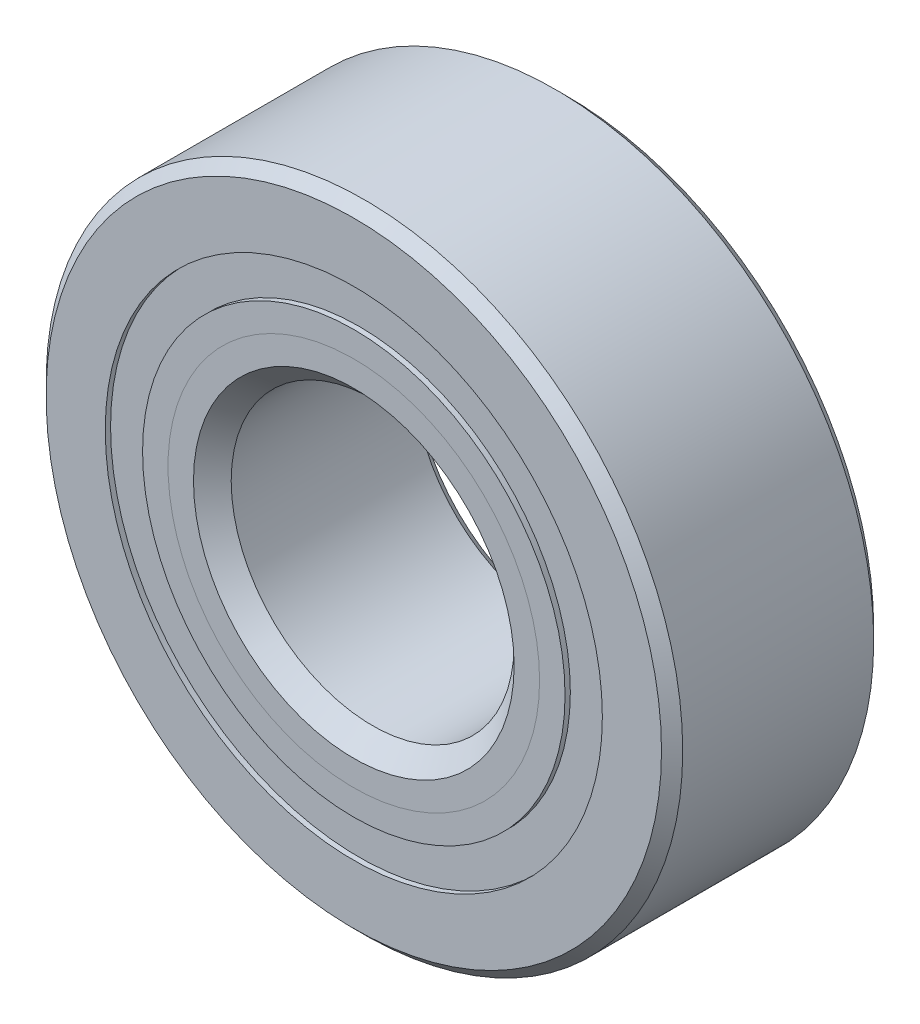
ISO-10303-21;
HEADER;
FILE_DESCRIPTION(('STEP AP214'),'2;1');
FILE_NAME('part.step','',(''),(''),'','','');
FILE_SCHEMA(('AUTOMOTIVE_DESIGN { 1 0 10303 214 1 1 1 1 }'));
ENDSEC;
DATA;
#1=APPLICATION_CONTEXT('core data for automotive mechanical design processes');
#2=APPLICATION_PROTOCOL_DEFINITION('international standard','automotive_design',2000,#1);
#3=PRODUCT_CONTEXT('',#1,'mechanical');
#4=PRODUCT('Part','Part','',(#3));
#5=PRODUCT_RELATED_PRODUCT_CATEGORY('part','',(#4));
#6=PRODUCT_DEFINITION_FORMATION('','',#4);
#7=PRODUCT_DEFINITION_CONTEXT('part definition',#1,'design');
#8=PRODUCT_DEFINITION('design','',#6,#7);
#9=PRODUCT_DEFINITION_SHAPE('','',#8);
#10=(LENGTH_UNIT() NAMED_UNIT(*) SI_UNIT(.MILLI.,.METRE.));
#11=(NAMED_UNIT(*) PLANE_ANGLE_UNIT() SI_UNIT($,.RADIAN.));
#12=(NAMED_UNIT(*) SI_UNIT($,.STERADIAN.) SOLID_ANGLE_UNIT());
#13=UNCERTAINTY_MEASURE_WITH_UNIT(LENGTH_MEASURE(1.E-05),#10,'distance_accuracy_value','');
#14=(GEOMETRIC_REPRESENTATION_CONTEXT(3) GLOBAL_UNCERTAINTY_ASSIGNED_CONTEXT((#13)) GLOBAL_UNIT_ASSIGNED_CONTEXT((#10,
#11,#12)) REPRESENTATION_CONTEXT('',''));
#15=CARTESIAN_POINT('',(0.,0.,0.));
#16=DIRECTION('',(0.,0.,1.));
#17=DIRECTION('',(1.,0.,0.));
#18=AXIS2_PLACEMENT_3D('',#15,#16,#17);
#19=CARTESIAN_POINT('',(0.,11.1561126373626,-4.524375));
#20=DIRECTION('',(0.,0.,1.));
#21=DIRECTION('',(1.,0.,0.));
#22=AXIS2_PLACEMENT_3D('',#19,#20,#21);
#23=PLANE('',#22);
#24=CARTESIAN_POINT('',(0.,0.,-4.524375));
#25=DIRECTION('',(0.,0.,1.));
#26=DIRECTION('',(1.,0.,0.));
#27=AXIS2_PLACEMENT_3D('',#24,#25,#26);
#28=CIRCLE('',#27,11.1561126373626);
#29=CARTESIAN_POINT('',(11.1561126373626,0.,-4.524375));
#30=VERTEX_POINT('',#29);
#31=EDGE_CURVE('E57',#30,#30,#28,.T.);
#32=ORIENTED_EDGE('',*,*,#31,.F.);
#33=EDGE_LOOP('',(#32));
#34=FACE_BOUND('',#33,.T.);
#35=CARTESIAN_POINT('',(0.,0.,-4.524375));
#36=DIRECTION('',(0.,0.,1.));
#37=DIRECTION('',(1.,0.,0.));
#38=AXIS2_PLACEMENT_3D('',#35,#36,#37);
#39=CIRCLE('',#38,9.48138736263737);
#40=CARTESIAN_POINT('',(9.48138736263737,0.,-4.524375));
#41=VERTEX_POINT('',#40);
#42=EDGE_CURVE('E11',#41,#41,#39,.T.);
#43=ORIENTED_EDGE('',*,*,#42,.T.);
#44=EDGE_LOOP('',(#43));
#45=FACE_BOUND('',#44,.T.);
#46=ADVANCED_FACE('F43',(#34,#45),#23,.F.);
#47=CARTESIAN_POINT('',(0.,0.,4.7625));
#48=DIRECTION('',(0.,0.,1.));
#49=DIRECTION('',(1.,0.,0.));
#50=AXIS2_PLACEMENT_3D('',#47,#48,#49);
#51=CYLINDRICAL_SURFACE('',#50,9.48138736263737);
#52=ORIENTED_EDGE('',*,*,#42,.F.);
#53=EDGE_LOOP('',(#52));
#54=FACE_BOUND('',#53,.T.);
#55=CARTESIAN_POINT('',(0.,0.,-2.27628073054021));
#56=DIRECTION('',(0.,0.,1.));
#57=DIRECTION('',(1.,0.,0.));
#58=AXIS2_PLACEMENT_3D('',#55,#56,#57);
#59=CIRCLE('',#58,9.48138736263736);
#60=CARTESIAN_POINT('',(9.48138736263736,0.,-2.27628073054021));
#61=VERTEX_POINT('',#60);
#62=EDGE_CURVE('E49',#61,#61,#59,.T.);
#63=ORIENTED_EDGE('',*,*,#62,.T.);
#64=EDGE_LOOP('',(#63));
#65=FACE_BOUND('',#64,.T.);
#66=ADVANCED_FACE('F66',(#54,#65),#51,.F.);
#67=CARTESIAN_POINT('',(0.,11.1561126373626,-2.27628073054021));
#68=DIRECTION('',(0.,0.,-1.));
#69=DIRECTION('',(-1.,0.,0.));
#70=AXIS2_PLACEMENT_3D('',#67,#68,#69);
#71=PLANE('',#70);
#72=ORIENTED_EDGE('',*,*,#62,.F.);
#73=EDGE_LOOP('',(#72));
#74=FACE_BOUND('',#73,.T.);
#75=CARTESIAN_POINT('',(0.,0.,-2.27628073054021));
#76=DIRECTION('',(0.,0.,1.));
#77=DIRECTION('',(1.,0.,0.));
#78=AXIS2_PLACEMENT_3D('',#75,#76,#77);
#79=CIRCLE('',#78,11.1561126373626);
#80=CARTESIAN_POINT('',(11.1561126373626,0.,-2.27628073054021));
#81=VERTEX_POINT('',#80);
#82=EDGE_CURVE('E53',#81,#81,#79,.T.);
#83=ORIENTED_EDGE('',*,*,#82,.T.);
#84=EDGE_LOOP('',(#83));
#85=FACE_BOUND('',#84,.T.);
#86=ADVANCED_FACE('F70',(#74,#85),#71,.F.);
#87=CARTESIAN_POINT('',(0.,0.,4.7625));
#88=DIRECTION('',(0.,0.,1.));
#89=DIRECTION('',(1.,0.,0.));
#90=AXIS2_PLACEMENT_3D('',#87,#88,#89);
#91=CYLINDRICAL_SURFACE('',#90,11.1561126373626);
#92=ORIENTED_EDGE('',*,*,#82,.F.);
#93=EDGE_LOOP('',(#92));
#94=FACE_BOUND('',#93,.T.);
#95=ORIENTED_EDGE('',*,*,#31,.T.);
#96=EDGE_LOOP('',(#95));
#97=FACE_BOUND('',#96,.T.);
#98=ADVANCED_FACE('F63',(#94,#97),#91,.T.);
#99=CLOSED_SHELL('',(#46,#66,#86,#98));
#100=MANIFOLD_SOLID_BREP('B2',#99);
#101=CARTESIAN_POINT('',(0.,11.1561126373626,4.524375));
#102=DIRECTION('',(0.,0.,-1.));
#103=DIRECTION('',(-1.,0.,0.));
#104=AXIS2_PLACEMENT_3D('',#101,#102,#103);
#105=PLANE('',#104);
#106=CARTESIAN_POINT('',(0.,0.,4.524375));
#107=DIRECTION('',(0.,0.,1.));
#108=DIRECTION('',(1.,0.,0.));
#109=AXIS2_PLACEMENT_3D('',#106,#107,#108);
#110=CIRCLE('',#109,9.48138736263736);
#111=CARTESIAN_POINT('',(9.48138736263736,0.,4.524375));
#112=VERTEX_POINT('',#111);
#113=EDGE_CURVE('E42',#112,#112,#110,.T.);
#114=ORIENTED_EDGE('',*,*,#113,.F.);
#115=EDGE_LOOP('',(#114));
#116=FACE_BOUND('',#115,.T.);
#117=CARTESIAN_POINT('',(0.,0.,4.524375));
#118=DIRECTION('',(0.,0.,1.));
#119=DIRECTION('',(1.,0.,0.));
#120=AXIS2_PLACEMENT_3D('',#117,#118,#119);
#121=CIRCLE('',#120,11.1561126373626);
#122=CARTESIAN_POINT('',(11.1561126373626,0.,4.524375));
#123=VERTEX_POINT('',#122);
#124=EDGE_CURVE('E124',#123,#123,#121,.T.);
#125=ORIENTED_EDGE('',*,*,#124,.T.);
#126=EDGE_LOOP('',(#125));
#127=FACE_BOUND('',#126,.T.);
#128=ADVANCED_FACE('F110',(#116,#127),#105,.F.);
#129=CARTESIAN_POINT('',(0.,0.,4.7625));
#130=DIRECTION('',(0.,0.,1.));
#131=DIRECTION('',(1.,0.,0.));
#132=AXIS2_PLACEMENT_3D('',#129,#130,#131);
#133=CYLINDRICAL_SURFACE('',#132,9.48138736263736);
#134=CARTESIAN_POINT('',(0.,0.,2.27628073054021));
#135=DIRECTION('',(0.,0.,1.));
#136=DIRECTION('',(1.,0.,0.));
#137=AXIS2_PLACEMENT_3D('',#134,#135,#136);
#138=CIRCLE('',#137,9.48138736263736);
#139=CARTESIAN_POINT('',(9.48138736263736,0.,2.27628073054021));
#140=VERTEX_POINT('',#139);
#141=EDGE_CURVE('E116',#140,#140,#138,.T.);
#142=ORIENTED_EDGE('',*,*,#141,.F.);
#143=EDGE_LOOP('',(#142));
#144=FACE_BOUND('',#143,.T.);
#145=ORIENTED_EDGE('',*,*,#113,.T.);
#146=EDGE_LOOP('',(#145));
#147=FACE_BOUND('',#146,.T.);
#148=ADVANCED_FACE('F139',(#144,#147),#133,.F.);
#149=CARTESIAN_POINT('',(0.,11.1561126373626,2.27628073054021));
#150=DIRECTION('',(0.,0.,1.));
#151=DIRECTION('',(1.,0.,0.));
#152=AXIS2_PLACEMENT_3D('',#149,#150,#151);
#153=PLANE('',#152);
#154=CARTESIAN_POINT('',(0.,0.,2.27628073054021));
#155=DIRECTION('',(0.,0.,1.));
#156=DIRECTION('',(1.,0.,0.));
#157=AXIS2_PLACEMENT_3D('',#154,#155,#156);
#158=CIRCLE('',#157,11.1561126373626);
#159=CARTESIAN_POINT('',(11.1561126373626,0.,2.27628073054021));
#160=VERTEX_POINT('',#159);
#161=EDGE_CURVE('E120',#160,#160,#158,.T.);
#162=ORIENTED_EDGE('',*,*,#161,.F.);
#163=EDGE_LOOP('',(#162));
#164=FACE_BOUND('',#163,.T.);
#165=ORIENTED_EDGE('',*,*,#141,.T.);
#166=EDGE_LOOP('',(#165));
#167=FACE_BOUND('',#166,.T.);
#168=ADVANCED_FACE('F134',(#164,#167),#153,.F.);
#169=CARTESIAN_POINT('',(0.,0.,4.7625));
#170=DIRECTION('',(0.,0.,1.));
#171=DIRECTION('',(1.,0.,0.));
#172=AXIS2_PLACEMENT_3D('',#169,#170,#171);
#173=CYLINDRICAL_SURFACE('',#172,11.1561126373626);
#174=ORIENTED_EDGE('',*,*,#124,.F.);
#175=EDGE_LOOP('',(#174));
#176=FACE_BOUND('',#175,.T.);
#177=ORIENTED_EDGE('',*,*,#161,.T.);
#178=EDGE_LOOP('',(#177));
#179=FACE_BOUND('',#178,.T.);
#180=ADVANCED_FACE('F131',(#176,#179),#173,.T.);
#181=CLOSED_SHELL('',(#128,#148,#168,#180));
#182=MANIFOLD_SOLID_BREP('B6',#181);
#183=CARTESIAN_POINT('',(-6.06520907209285,8.34804411070657,0.));
#184=DIRECTION('',(0.,0.,1.));
#185=DIRECTION('',(-0.587785252292462,0.809016994374955,0.));
#186=AXIS2_PLACEMENT_3D('',#183,#184,#185);
#187=SPHERICAL_SURFACE('',#186,2.27628073054021);
#188=CARTESIAN_POINT('',(-6.06520907209285,8.34804411070657,2.27628073054021));
#189=VERTEX_POINT('',#188);
#190=VERTEX_LOOP('',#189);
#191=FACE_BOUND('',#190,.T.);
#192=ADVANCED_FACE('F177',(#191),#187,.T.);
#193=CLOSED_SHELL('',(#192));
#194=MANIFOLD_SOLID_BREP('B37',#193);
#195=CARTESIAN_POINT('',(-9.81371442752058,3.1886691107066,0.));
#196=DIRECTION('',(0.,0.,1.));
#197=DIRECTION('',(-0.95105651629515,0.309016994374958,0.));
#198=AXIS2_PLACEMENT_3D('',#195,#196,#197);
#199=SPHERICAL_SURFACE('',#198,2.27628073054021);
#200=CARTESIAN_POINT('',(-9.81371442752058,3.1886691107066,2.27628073054021));
#201=VERTEX_POINT('',#200);
#202=VERTEX_LOOP('',#201);
#203=FACE_BOUND('',#202,.T.);
#204=ADVANCED_FACE('F210',(#203),#199,.T.);
#205=CLOSED_SHELL('',(#204));
#206=MANIFOLD_SOLID_BREP('B106',#205);
#207=CARTESIAN_POINT('',(-9.81371442752065,-3.18866911070639,0.));
#208=DIRECTION('',(0.,0.,1.));
#209=DIRECTION('',(-0.951056516295157,-0.309016994374938,0.));
#210=AXIS2_PLACEMENT_3D('',#207,#208,#209);
#211=SPHERICAL_SURFACE('',#210,2.27628073054021);
#212=CARTESIAN_POINT('',(-9.81371442752065,-3.18866911070639,2.27628073054021));
#213=VERTEX_POINT('',#212);
#214=VERTEX_LOOP('',#213);
#215=FACE_BOUND('',#214,.T.);
#216=ADVANCED_FACE('F241',(#215),#211,.T.);
#217=CLOSED_SHELL('',(#216));
#218=MANIFOLD_SOLID_BREP('B173',#217);
#219=CARTESIAN_POINT('',(-6.06520907209303,-8.34804411070643,0.));
#220=DIRECTION('',(0.,0.,1.));
#221=DIRECTION('',(-0.58778525229248,-0.809016994374942,0.));
#222=AXIS2_PLACEMENT_3D('',#219,#220,#221);
#223=SPHERICAL_SURFACE('',#222,2.27628073054021);
#224=CARTESIAN_POINT('',(-6.06520907209303,-8.34804411070643,2.27628073054021));
#225=VERTEX_POINT('',#224);
#226=VERTEX_LOOP('',#225);
#227=FACE_BOUND('',#226,.T.);
#228=ADVANCED_FACE('F272',(#227),#223,.T.);
#229=CLOSED_SHELL('',(#228));
#230=MANIFOLD_SOLID_BREP('B206',#229);
#231=CARTESIAN_POINT('',(0.,-10.31875,0.));
#232=DIRECTION('',(0.,0.,1.));
#233=DIRECTION('',(0.,-1.,0.));
#234=AXIS2_PLACEMENT_3D('',#231,#232,#233);
#235=SPHERICAL_SURFACE('',#234,2.27628073054021);
#236=CARTESIAN_POINT('',(0.,-10.31875,2.27628073054021));
#237=VERTEX_POINT('',#236);
#238=VERTEX_LOOP('',#237);
#239=FACE_BOUND('',#238,.T.);
#240=ADVANCED_FACE('F305',(#239),#235,.T.);
#241=CLOSED_SHELL('',(#240));
#242=MANIFOLD_SOLID_BREP('B237',#241);
#243=CARTESIAN_POINT('',(6.06520907209291,-8.34804411070652,0.));
#244=DIRECTION('',(0.,0.,1.));
#245=DIRECTION('',(0.587785252292469,-0.809016994374951,0.));
#246=AXIS2_PLACEMENT_3D('',#243,#244,#245);
#247=SPHERICAL_SURFACE('',#246,2.27628073054021);
#248=CARTESIAN_POINT('',(6.06520907209291,-8.34804411070652,2.27628073054021));
#249=VERTEX_POINT('',#248);
#250=VERTEX_LOOP('',#249);
#251=FACE_BOUND('',#250,.T.);
#252=ADVANCED_FACE('F338',(#251),#247,.T.);
#253=CLOSED_SHELL('',(#252));
#254=MANIFOLD_SOLID_BREP('B268',#253);
#255=CARTESIAN_POINT('',(9.8137144275206,-3.18866911070653,0.));
#256=DIRECTION('',(0.,0.,1.));
#257=DIRECTION('',(0.951056516295152,-0.309016994374952,0.));
#258=AXIS2_PLACEMENT_3D('',#255,#256,#257);
#259=SPHERICAL_SURFACE('',#258,2.27628073054021);
#260=CARTESIAN_POINT('',(9.8137144275206,-3.18866911070653,2.27628073054021));
#261=VERTEX_POINT('',#260);
#262=VERTEX_LOOP('',#261);
#263=FACE_BOUND('',#262,.T.);
#264=ADVANCED_FACE('F371',(#263),#259,.T.);
#265=CLOSED_SHELL('',(#264));
#266=MANIFOLD_SOLID_BREP('B301',#265);
#267=CARTESIAN_POINT('',(9.81371442752063,3.18866911070646,0.));
#268=DIRECTION('',(0.,0.,1.));
#269=DIRECTION('',(0.951056516295155,0.309016994374945,0.));
#270=AXIS2_PLACEMENT_3D('',#267,#268,#269);
#271=SPHERICAL_SURFACE('',#270,2.27628073054021);
#272=CARTESIAN_POINT('',(9.81371442752063,3.18866911070646,2.27628073054021));
#273=VERTEX_POINT('',#272);
#274=VERTEX_LOOP('',#273);
#275=FACE_BOUND('',#274,.T.);
#276=ADVANCED_FACE('F402',(#275),#271,.T.);
#277=CLOSED_SHELL('',(#276));
#278=MANIFOLD_SOLID_BREP('B334',#277);
#279=CARTESIAN_POINT('',(6.06520907209297,8.34804411070648,0.));
#280=DIRECTION('',(0.,0.,1.));
#281=DIRECTION('',(0.587785252292474,0.809016994374947,0.));
#282=AXIS2_PLACEMENT_3D('',#279,#280,#281);
#283=SPHERICAL_SURFACE('',#282,2.27628073054021);
#284=CARTESIAN_POINT('',(6.06520907209297,8.34804411070648,2.27628073054021));
#285=VERTEX_POINT('',#284);
#286=VERTEX_LOOP('',#285);
#287=FACE_BOUND('',#286,.T.);
#288=ADVANCED_FACE('F435',(#287),#283,.T.);
#289=CLOSED_SHELL('',(#288));
#290=MANIFOLD_SOLID_BREP('B367',#289);
#291=CARTESIAN_POINT('',(0.,10.31875,0.));
#292=DIRECTION('',(0.,0.,1.));
#293=DIRECTION('',(0.,1.,0.));
#294=AXIS2_PLACEMENT_3D('',#291,#292,#293);
#295=SPHERICAL_SURFACE('',#294,2.27628073054021);
#296=CARTESIAN_POINT('',(0.,10.31875,2.27628073054021));
#297=VERTEX_POINT('',#296);
#298=VERTEX_LOOP('',#297);
#299=FACE_BOUND('',#298,.T.);
#300=ADVANCED_FACE('F470',(#299),#295,.T.);
#301=CLOSED_SHELL('',(#300));
#302=MANIFOLD_SOLID_BREP('B398',#301);
#303=CARTESIAN_POINT('',(0.,8.33881099868363,4.7625));
#304=DIRECTION('',(0.,0.,-1.));
#305=DIRECTION('',(-1.,0.,0.));
#306=AXIS2_PLACEMENT_3D('',#303,#304,#305);
#307=PLANE('',#306);
#308=CARTESIAN_POINT('',(0.,0.,4.7625));
#309=DIRECTION('',(0.,0.,1.));
#310=DIRECTION('',(1.,0.,0.));
#311=AXIS2_PLACEMENT_3D('',#308,#309,#310);
#312=CIRCLE('',#311,7.19623463472989);
#313=CARTESIAN_POINT('',(7.19623463472989,0.,4.7625));
#314=VERTEX_POINT('',#313);
#315=EDGE_CURVE('E524',#314,#314,#312,.T.);
#316=ORIENTED_EDGE('',*,*,#315,.F.);
#317=EDGE_LOOP('',(#316));
#318=FACE_BOUND('',#317,.T.);
#319=CARTESIAN_POINT('',(0.,0.,4.7625));
#320=DIRECTION('',(0.,0.,1.));
#321=DIRECTION('',(1.,0.,0.));
#322=AXIS2_PLACEMENT_3D('',#319,#320,#321);
#323=CIRCLE('',#322,8.33881099868363);
#324=CARTESIAN_POINT('',(8.33881099868363,0.,4.7625));
#325=VERTEX_POINT('',#324);
#326=EDGE_CURVE('E469',#325,#325,#323,.T.);
#327=ORIENTED_EDGE('',*,*,#326,.T.);
#328=EDGE_LOOP('',(#327));
#329=FACE_BOUND('',#328,.T.);
#330=ADVANCED_FACE('F490',(#318,#329),#307,.F.);
#331=CARTESIAN_POINT('',(0.,0.,3.61992363604627));
#332=DIRECTION('',(0.,0.,1.));
#333=DIRECTION('',(1.,0.,0.));
#334=AXIS2_PLACEMENT_3D('',#331,#332,#333);
#335=CONICAL_SURFACE('',#334,7.19623463472989,0.78539816339745);
#336=ORIENTED_EDGE('',*,*,#326,.F.);
#337=EDGE_LOOP('',(#336));
#338=FACE_BOUND('',#337,.T.);
#339=CARTESIAN_POINT('',(0.,0.,3.61992363604627));
#340=DIRECTION('',(0.,0.,1.));
#341=DIRECTION('',(1.,0.,0.));
#342=AXIS2_PLACEMENT_3D('',#339,#340,#341);
#343=CIRCLE('',#342,7.19623463472989);
#344=CARTESIAN_POINT('',(7.19623463472989,0.,3.61992363604627));
#345=VERTEX_POINT('',#344);
#346=EDGE_CURVE('E496',#345,#345,#343,.T.);
#347=ORIENTED_EDGE('',*,*,#346,.T.);
#348=EDGE_LOOP('',(#347));
#349=FACE_BOUND('',#348,.T.);
#350=ADVANCED_FACE('F531',(#338,#349),#335,.T.);
#351=CARTESIAN_POINT('',(0.,0.,4.7625));
#352=DIRECTION('',(0.,0.,1.));
#353=DIRECTION('',(1.,0.,0.));
#354=AXIS2_PLACEMENT_3D('',#351,#352,#353);
#355=CYLINDRICAL_SURFACE('',#354,7.19623463472989);
#356=ORIENTED_EDGE('',*,*,#346,.F.);
#357=EDGE_LOOP('',(#356));
#358=FACE_BOUND('',#357,.T.);
#359=CARTESIAN_POINT('',(0.,0.,0.));
#360=DIRECTION('',(0.,0.,1.));
#361=DIRECTION('',(1.,0.,0.));
#362=AXIS2_PLACEMENT_3D('',#359,#360,#361);
#363=CIRCLE('',#362,7.19623463472989);
#364=CARTESIAN_POINT('',(7.19623463472989,0.,0.));
#365=VERTEX_POINT('',#364);
#366=EDGE_CURVE('E500',#365,#365,#363,.T.);
#367=ORIENTED_EDGE('',*,*,#366,.T.);
#368=EDGE_LOOP('',(#367));
#369=FACE_BOUND('',#368,.T.);
#370=ADVANCED_FACE('F535',(#358,#369),#355,.T.);
#371=CARTESIAN_POINT('',(0.,7.19623463472989,0.));
#372=DIRECTION('',(0.,0.,-1.));
#373=DIRECTION('',(-1.,0.,0.));
#374=AXIS2_PLACEMENT_3D('',#371,#372,#373);
#375=PLANE('',#374);
#376=ORIENTED_EDGE('',*,*,#366,.F.);
#377=EDGE_LOOP('',(#376));
#378=FACE_BOUND('',#377,.T.);
#379=CARTESIAN_POINT('',(0.,0.,0.));
#380=DIRECTION('',(0.,0.,1.));
#381=DIRECTION('',(1.,0.,0.));
#382=AXIS2_PLACEMENT_3D('',#379,#380,#381);
#383=CIRCLE('',#382,8.04246926945979);
#384=CARTESIAN_POINT('',(8.04246926945979,0.,0.));
#385=VERTEX_POINT('',#384);
#386=EDGE_CURVE('E504',#385,#385,#383,.T.);
#387=ORIENTED_EDGE('',*,*,#386,.T.);
#388=EDGE_LOOP('',(#387));
#389=FACE_BOUND('',#388,.T.);
#390=ADVANCED_FACE('F540',(#378,#389),#375,.F.);
#391=CARTESIAN_POINT('',(0.,0.,0.));
#392=DIRECTION('',(0.,0.,1.));
#393=DIRECTION('',(1.,0.,0.));
#394=AXIS2_PLACEMENT_3D('',#391,#392,#393);
#395=TOROIDAL_SURFACE('',#394,10.31875,2.27628073054021);
#396=ORIENTED_EDGE('',*,*,#386,.F.);
#397=EDGE_LOOP('',(#396));
#398=FACE_BOUND('',#397,.T.);
#399=CARTESIAN_POINT('',(0.,0.,-2.11666666666666));
#400=DIRECTION('',(0.,0.,1.));
#401=DIRECTION('',(1.,0.,0.));
#402=AXIS2_PLACEMENT_3D('',#399,#400,#401);
#403=CIRCLE('',#402,9.48138736263736);
#404=CARTESIAN_POINT('',(9.48138736263736,0.,-2.11666666666666));
#405=VERTEX_POINT('',#404);
#406=EDGE_CURVE('E509',#405,#405,#403,.T.);
#407=ORIENTED_EDGE('',*,*,#406,.T.);
#408=EDGE_LOOP('',(#407));
#409=FACE_BOUND('',#408,.T.);
#410=ADVANCED_FACE('F546',(#398,#409),#395,.F.);
#411=CARTESIAN_POINT('',(0.,0.,4.7625));
#412=DIRECTION('',(0.,0.,1.));
#413=DIRECTION('',(1.,0.,0.));
#414=AXIS2_PLACEMENT_3D('',#411,#412,#413);
#415=CYLINDRICAL_SURFACE('',#414,9.48138736263736);
#416=ORIENTED_EDGE('',*,*,#406,.F.);
#417=EDGE_LOOP('',(#416));
#418=FACE_BOUND('',#417,.T.);
#419=CARTESIAN_POINT('',(0.,0.,-4.7625));
#420=DIRECTION('',(0.,0.,1.));
#421=DIRECTION('',(1.,0.,0.));
#422=AXIS2_PLACEMENT_3D('',#419,#420,#421);
#423=CIRCLE('',#422,9.48138736263736);
#424=CARTESIAN_POINT('',(9.48138736263736,0.,-4.7625));
#425=VERTEX_POINT('',#424);
#426=EDGE_CURVE('E512',#425,#425,#423,.T.);
#427=ORIENTED_EDGE('',*,*,#426,.T.);
#428=EDGE_LOOP('',(#427));
#429=FACE_BOUND('',#428,.T.);
#430=ADVANCED_FACE('F550',(#418,#429),#415,.T.);
#431=CARTESIAN_POINT('',(0.,6.82625,-4.7625));
#432=DIRECTION('',(0.,0.,1.));
#433=DIRECTION('',(1.,0.,0.));
#434=AXIS2_PLACEMENT_3D('',#431,#432,#433);
#435=PLANE('',#434);
#436=ORIENTED_EDGE('',*,*,#426,.F.);
#437=EDGE_LOOP('',(#436));
#438=FACE_BOUND('',#437,.T.);
#439=CARTESIAN_POINT('',(0.,0.,-4.7625));
#440=DIRECTION('',(0.,0.,1.));
#441=DIRECTION('',(1.,0.,0.));
#442=AXIS2_PLACEMENT_3D('',#439,#440,#441);
#443=CIRCLE('',#442,6.82625);
#444=CARTESIAN_POINT('',(6.82625,0.,-4.7625));
#445=VERTEX_POINT('',#444);
#446=EDGE_CURVE('E515',#445,#445,#443,.T.);
#447=ORIENTED_EDGE('',*,*,#446,.T.);
#448=EDGE_LOOP('',(#447));
#449=FACE_BOUND('',#448,.T.);
#450=ADVANCED_FACE('F554',(#438,#449),#435,.F.);
#451=CARTESIAN_POINT('',(0.,0.,-4.28625));
#452=DIRECTION('',(0.,0.,-1.));
#453=DIRECTION('',(-1.,0.,0.));
#454=AXIS2_PLACEMENT_3D('',#451,#452,#453);
#455=CONICAL_SURFACE('',#454,6.35,0.785398163397448);
#456=ORIENTED_EDGE('',*,*,#446,.F.);
#457=EDGE_LOOP('',(#456));
#458=FACE_BOUND('',#457,.T.);
#459=CARTESIAN_POINT('',(0.,0.,-4.28625));
#460=DIRECTION('',(0.,0.,1.));
#461=DIRECTION('',(1.,0.,0.));
#462=AXIS2_PLACEMENT_3D('',#459,#460,#461);
#463=CIRCLE('',#462,6.35);
#464=CARTESIAN_POINT('',(6.35,0.,-4.28625));
#465=VERTEX_POINT('',#464);
#466=EDGE_CURVE('E518',#465,#465,#463,.T.);
#467=ORIENTED_EDGE('',*,*,#466,.T.);
#468=EDGE_LOOP('',(#467));
#469=FACE_BOUND('',#468,.T.);
#470=ADVANCED_FACE('F558',(#458,#469),#455,.F.);
#471=CARTESIAN_POINT('',(0.,0.,4.7625));
#472=DIRECTION('',(0.,0.,1.));
#473=DIRECTION('',(1.,0.,0.));
#474=AXIS2_PLACEMENT_3D('',#471,#472,#473);
#475=CYLINDRICAL_SURFACE('',#474,6.35);
#476=ORIENTED_EDGE('',*,*,#466,.F.);
#477=EDGE_LOOP('',(#476));
#478=FACE_BOUND('',#477,.T.);
#479=CARTESIAN_POINT('',(0.,0.,3.91626536527011));
#480=DIRECTION('',(0.,0.,1.));
#481=DIRECTION('',(1.,0.,0.));
#482=AXIS2_PLACEMENT_3D('',#479,#480,#481);
#483=CIRCLE('',#482,6.35);
#484=CARTESIAN_POINT('',(6.35,0.,3.91626536527011));
#485=VERTEX_POINT('',#484);
#486=EDGE_CURVE('E521',#485,#485,#483,.T.);
#487=ORIENTED_EDGE('',*,*,#486,.T.);
#488=EDGE_LOOP('',(#487));
#489=FACE_BOUND('',#488,.T.);
#490=ADVANCED_FACE('F562',(#478,#489),#475,.F.);
#491=CARTESIAN_POINT('',(0.,0.,4.7625));
#492=DIRECTION('',(0.,0.,1.));
#493=DIRECTION('',(1.,0.,0.));
#494=AXIS2_PLACEMENT_3D('',#491,#492,#493);
#495=CONICAL_SURFACE('',#494,7.19623463472989,0.78539816339745);
#496=ORIENTED_EDGE('',*,*,#486,.F.);
#497=EDGE_LOOP('',(#496));
#498=FACE_BOUND('',#497,.T.);
#499=ORIENTED_EDGE('',*,*,#315,.T.);
#500=EDGE_LOOP('',(#499));
#501=FACE_BOUND('',#500,.T.);
#502=ADVANCED_FACE('F528',(#498,#501),#495,.F.);
#503=CLOSED_SHELL('',(#330,#350,#370,#390,#410,#430,#450,#470,#490,#502));
#504=MANIFOLD_SOLID_BREP('B431',#503);
#505=CARTESIAN_POINT('',(0.,9.48138736263736,4.7625));
#506=DIRECTION('',(0.,0.,-1.));
#507=DIRECTION('',(-1.,0.,0.));
#508=AXIS2_PLACEMENT_3D('',#505,#506,#507);
#509=PLANE('',#508);
#510=CARTESIAN_POINT('',(0.,0.,4.7625));
#511=DIRECTION('',(0.,0.,1.));
#512=DIRECTION('',(1.,0.,0.));
#513=AXIS2_PLACEMENT_3D('',#510,#511,#512);
#514=CIRCLE('',#513,8.33881099868363);
#515=CARTESIAN_POINT('',(8.33881099868363,0.,4.7625));
#516=VERTEX_POINT('',#515);
#517=EDGE_CURVE('E489',#516,#516,#514,.T.);
#518=ORIENTED_EDGE('',*,*,#517,.F.);
#519=EDGE_LOOP('',(#518));
#520=FACE_BOUND('',#519,.T.);
#521=CARTESIAN_POINT('',(0.,0.,4.7625));
#522=DIRECTION('',(0.,0.,1.));
#523=DIRECTION('',(1.,0.,0.));
#524=AXIS2_PLACEMENT_3D('',#521,#522,#523);
#525=CIRCLE('',#524,9.48138736263736);
#526=CARTESIAN_POINT('',(9.48138736263736,0.,4.7625));
#527=VERTEX_POINT('',#526);
#528=EDGE_CURVE('E670',#527,#527,#525,.T.);
#529=ORIENTED_EDGE('',*,*,#528,.T.);
#530=EDGE_LOOP('',(#529));
#531=FACE_BOUND('',#530,.T.);
#532=ADVANCED_FACE('F648',(#520,#531),#509,.F.);
#533=CARTESIAN_POINT('',(0.,0.,4.7625));
#534=DIRECTION('',(0.,0.,1.));
#535=DIRECTION('',(1.,0.,0.));
#536=AXIS2_PLACEMENT_3D('',#533,#534,#535);
#537=CONICAL_SURFACE('',#536,8.33881099868363,0.78539816339745);
#538=CARTESIAN_POINT('',(0.,0.,3.61992363604627));
#539=DIRECTION('',(0.,0.,1.));
#540=DIRECTION('',(1.,0.,0.));
#541=AXIS2_PLACEMENT_3D('',#538,#539,#540);
#542=CIRCLE('',#541,7.19623463472989);
#543=CARTESIAN_POINT('',(7.19623463472989,0.,3.61992363604627));
#544=VERTEX_POINT('',#543);
#545=EDGE_CURVE('E654',#544,#544,#542,.T.);
#546=ORIENTED_EDGE('',*,*,#545,.F.);
#547=EDGE_LOOP('',(#546));
#548=FACE_BOUND('',#547,.T.);
#549=ORIENTED_EDGE('',*,*,#517,.T.);
#550=EDGE_LOOP('',(#549));
#551=FACE_BOUND('',#550,.T.);
#552=ADVANCED_FACE('F695',(#548,#551),#537,.F.);
#553=CARTESIAN_POINT('',(0.,0.,4.7625));
#554=DIRECTION('',(0.,0.,1.));
#555=DIRECTION('',(1.,0.,0.));
#556=AXIS2_PLACEMENT_3D('',#553,#554,#555);
#557=CYLINDRICAL_SURFACE('',#556,7.19623463472989);
#558=CARTESIAN_POINT('',(0.,0.,0.));
#559=DIRECTION('',(0.,0.,1.));
#560=DIRECTION('',(1.,0.,0.));
#561=AXIS2_PLACEMENT_3D('',#558,#559,#560);
#562=CIRCLE('',#561,7.19623463472989);
#563=CARTESIAN_POINT('',(7.19623463472989,0.,0.));
#564=VERTEX_POINT('',#563);
#565=EDGE_CURVE('E658',#564,#564,#562,.T.);
#566=ORIENTED_EDGE('',*,*,#565,.F.);
#567=EDGE_LOOP('',(#566));
#568=FACE_BOUND('',#567,.T.);
#569=ORIENTED_EDGE('',*,*,#545,.T.);
#570=EDGE_LOOP('',(#569));
#571=FACE_BOUND('',#570,.T.);
#572=ADVANCED_FACE('F690',(#568,#571),#557,.F.);
#573=CARTESIAN_POINT('',(0.,7.19623463472989,0.));
#574=DIRECTION('',(0.,0.,1.));
#575=DIRECTION('',(1.,0.,0.));
#576=AXIS2_PLACEMENT_3D('',#573,#574,#575);
#577=PLANE('',#576);
#578=CARTESIAN_POINT('',(0.,0.,0.));
#579=DIRECTION('',(0.,0.,1.));
#580=DIRECTION('',(1.,0.,0.));
#581=AXIS2_PLACEMENT_3D('',#578,#579,#580);
#582=CIRCLE('',#581,8.04246926945979);
#583=CARTESIAN_POINT('',(8.04246926945979,0.,0.));
#584=VERTEX_POINT('',#583);
#585=EDGE_CURVE('E662',#584,#584,#582,.T.);
#586=ORIENTED_EDGE('',*,*,#585,.F.);
#587=EDGE_LOOP('',(#586));
#588=FACE_BOUND('',#587,.T.);
#589=ORIENTED_EDGE('',*,*,#565,.T.);
#590=EDGE_LOOP('',(#589));
#591=FACE_BOUND('',#590,.T.);
#592=ADVANCED_FACE('F684',(#588,#591),#577,.F.);
#593=CARTESIAN_POINT('',(0.,0.,0.));
#594=DIRECTION('',(0.,0.,1.));
#595=DIRECTION('',(1.,0.,0.));
#596=AXIS2_PLACEMENT_3D('',#593,#594,#595);
#597=TOROIDAL_SURFACE('',#596,10.31875,2.27628073054021);
#598=CARTESIAN_POINT('',(0.,0.,2.11666666666666));
#599=DIRECTION('',(0.,0.,1.));
#600=DIRECTION('',(1.,0.,0.));
#601=AXIS2_PLACEMENT_3D('',#598,#599,#600);
#602=CIRCLE('',#601,9.48138736263736);
#603=CARTESIAN_POINT('',(9.48138736263736,0.,2.11666666666666));
#604=VERTEX_POINT('',#603);
#605=EDGE_CURVE('E667',#604,#604,#602,.T.);
#606=ORIENTED_EDGE('',*,*,#605,.F.);
#607=EDGE_LOOP('',(#606));
#608=FACE_BOUND('',#607,.T.);
#609=ORIENTED_EDGE('',*,*,#585,.T.);
#610=EDGE_LOOP('',(#609));
#611=FACE_BOUND('',#610,.T.);
#612=ADVANCED_FACE('F678',(#608,#611),#597,.F.);
#613=CARTESIAN_POINT('',(0.,0.,4.7625));
#614=DIRECTION('',(0.,0.,1.));
#615=DIRECTION('',(1.,0.,0.));
#616=AXIS2_PLACEMENT_3D('',#613,#614,#615);
#617=CYLINDRICAL_SURFACE('',#616,9.48138736263736);
#618=ORIENTED_EDGE('',*,*,#528,.F.);
#619=EDGE_LOOP('',(#618));
#620=FACE_BOUND('',#619,.T.);
#621=ORIENTED_EDGE('',*,*,#605,.T.);
#622=EDGE_LOOP('',(#621));
#623=FACE_BOUND('',#622,.T.);
#624=ADVANCED_FACE('F675',(#620,#623),#617,.T.);
#625=CLOSED_SHELL('',(#532,#552,#572,#592,#612,#624));
#626=MANIFOLD_SOLID_BREP('B464',#625);
#627=CARTESIAN_POINT('',(0.,0.,4.28625));
#628=DIRECTION('',(0.,0.,-1.));
#629=DIRECTION('',(-1.,0.,0.));
#630=AXIS2_PLACEMENT_3D('',#627,#628,#629);
#631=CONICAL_SURFACE('',#630,14.2875,0.785398163397446);
#632=CARTESIAN_POINT('',(0.,0.,4.7625));
#633=DIRECTION('',(0.,0.,1.));
#634=DIRECTION('',(1.,0.,0.));
#635=AXIS2_PLACEMENT_3D('',#632,#633,#634);
#636=CIRCLE('',#635,13.81125);
#637=CARTESIAN_POINT('',(13.81125,0.,4.7625));
#638=VERTEX_POINT('',#637);
#639=EDGE_CURVE('E767',#638,#638,#636,.T.);
#640=ORIENTED_EDGE('',*,*,#639,.F.);
#641=EDGE_LOOP('',(#640));
#642=FACE_BOUND('',#641,.T.);
#643=CARTESIAN_POINT('',(0.,0.,4.28625));
#644=DIRECTION('',(0.,0.,1.));
#645=DIRECTION('',(1.,0.,0.));
#646=AXIS2_PLACEMENT_3D('',#643,#644,#645);
#647=CIRCLE('',#646,14.2875);
#648=CARTESIAN_POINT('',(14.2875,0.,4.28625));
#649=VERTEX_POINT('',#648);
#650=EDGE_CURVE('E647',#649,#649,#647,.T.);
#651=ORIENTED_EDGE('',*,*,#650,.T.);
#652=EDGE_LOOP('',(#651));
#653=FACE_BOUND('',#652,.T.);
#654=ADVANCED_FACE('F739',(#642,#653),#631,.T.);
#655=CARTESIAN_POINT('',(0.,0.,4.7625));
#656=DIRECTION('',(0.,0.,1.));
#657=DIRECTION('',(1.,0.,0.));
#658=AXIS2_PLACEMENT_3D('',#655,#656,#657);
#659=CYLINDRICAL_SURFACE('',#658,14.2875);
#660=ORIENTED_EDGE('',*,*,#650,.F.);
#661=EDGE_LOOP('',(#660));
#662=FACE_BOUND('',#661,.T.);
#663=CARTESIAN_POINT('',(0.,0.,-4.28625));
#664=DIRECTION('',(0.,0.,1.));
#665=DIRECTION('',(1.,0.,0.));
#666=AXIS2_PLACEMENT_3D('',#663,#664,#665);
#667=CIRCLE('',#666,14.2875);
#668=CARTESIAN_POINT('',(14.2875,0.,-4.28625));
#669=VERTEX_POINT('',#668);
#670=EDGE_CURVE('E745',#669,#669,#667,.T.);
#671=ORIENTED_EDGE('',*,*,#670,.T.);
#672=EDGE_LOOP('',(#671));
#673=FACE_BOUND('',#672,.T.);
#674=ADVANCED_FACE('F774',(#662,#673),#659,.T.);
#675=CARTESIAN_POINT('',(0.,0.,-4.7625));
#676=DIRECTION('',(0.,0.,1.));
#677=DIRECTION('',(1.,0.,0.));
#678=AXIS2_PLACEMENT_3D('',#675,#676,#677);
#679=CONICAL_SURFACE('',#678,13.81125,0.785398163397447);
#680=ORIENTED_EDGE('',*,*,#670,.F.);
#681=EDGE_LOOP('',(#680));
#682=FACE_BOUND('',#681,.T.);
#683=CARTESIAN_POINT('',(0.,0.,-4.7625));
#684=DIRECTION('',(0.,0.,1.));
#685=DIRECTION('',(1.,0.,0.));
#686=AXIS2_PLACEMENT_3D('',#683,#684,#685);
#687=CIRCLE('',#686,13.81125);
#688=CARTESIAN_POINT('',(13.81125,0.,-4.7625));
#689=VERTEX_POINT('',#688);
#690=EDGE_CURVE('E749',#689,#689,#687,.T.);
#691=ORIENTED_EDGE('',*,*,#690,.T.);
#692=EDGE_LOOP('',(#691));
#693=FACE_BOUND('',#692,.T.);
#694=ADVANCED_FACE('F778',(#682,#693),#679,.T.);
#695=CARTESIAN_POINT('',(0.,13.81125,-4.7625));
#696=DIRECTION('',(0.,0.,1.));
#697=DIRECTION('',(1.,0.,0.));
#698=AXIS2_PLACEMENT_3D('',#695,#696,#697);
#699=PLANE('',#698);
#700=ORIENTED_EDGE('',*,*,#690,.F.);
#701=EDGE_LOOP('',(#700));
#702=FACE_BOUND('',#701,.T.);
#703=CARTESIAN_POINT('',(0.,0.,-4.76250000000001));
#704=DIRECTION('',(0.,0.,1.));
#705=DIRECTION('',(1.,0.,0.));
#706=AXIS2_PLACEMENT_3D('',#703,#704,#705);
#707=CIRCLE('',#706,11.1561126373626);
#708=CARTESIAN_POINT('',(11.1561126373626,0.,-4.76250000000001));
#709=VERTEX_POINT('',#708);
#710=EDGE_CURVE('E753',#709,#709,#707,.T.);
#711=ORIENTED_EDGE('',*,*,#710,.T.);
#712=EDGE_LOOP('',(#711));
#713=FACE_BOUND('',#712,.T.);
#714=ADVANCED_FACE('F783',(#702,#713),#699,.F.);
#715=CARTESIAN_POINT('',(0.,0.,4.7625));
#716=DIRECTION('',(0.,0.,1.));
#717=DIRECTION('',(1.,0.,0.));
#718=AXIS2_PLACEMENT_3D('',#715,#716,#717);
#719=CYLINDRICAL_SURFACE('',#718,11.1561126373626);
#720=ORIENTED_EDGE('',*,*,#710,.F.);
#721=EDGE_LOOP('',(#720));
#722=FACE_BOUND('',#721,.T.);
#723=CARTESIAN_POINT('',(0.,0.,-2.11666666666667));
#724=DIRECTION('',(0.,0.,1.));
#725=DIRECTION('',(1.,0.,0.));
#726=AXIS2_PLACEMENT_3D('',#723,#724,#725);
#727=CIRCLE('',#726,11.1561126373626);
#728=CARTESIAN_POINT('',(11.1561126373626,0.,-2.11666666666667));
#729=VERTEX_POINT('',#728);
#730=EDGE_CURVE('E758',#729,#729,#727,.T.);
#731=ORIENTED_EDGE('',*,*,#730,.T.);
#732=EDGE_LOOP('',(#731));
#733=FACE_BOUND('',#732,.T.);
#734=ADVANCED_FACE('F789',(#722,#733),#719,.F.);
#735=CARTESIAN_POINT('',(0.,0.,0.));
#736=DIRECTION('',(0.,0.,1.));
#737=DIRECTION('',(1.,0.,0.));
#738=AXIS2_PLACEMENT_3D('',#735,#736,#737);
#739=TOROIDAL_SURFACE('',#738,10.31875,2.27628073054021);
#740=ORIENTED_EDGE('',*,*,#730,.F.);
#741=EDGE_LOOP('',(#740));
#742=FACE_BOUND('',#741,.T.);
#743=CARTESIAN_POINT('',(0.,0.,2.11666666666667));
#744=DIRECTION('',(0.,0.,1.));
#745=DIRECTION('',(1.,0.,0.));
#746=AXIS2_PLACEMENT_3D('',#743,#744,#745);
#747=CIRCLE('',#746,11.1561126373626);
#748=CARTESIAN_POINT('',(11.1561126373626,0.,2.11666666666667));
#749=VERTEX_POINT('',#748);
#750=EDGE_CURVE('E761',#749,#749,#747,.T.);
#751=ORIENTED_EDGE('',*,*,#750,.T.);
#752=EDGE_LOOP('',(#751));
#753=FACE_BOUND('',#752,.T.);
#754=ADVANCED_FACE('F793',(#742,#753),#739,.F.);
#755=CARTESIAN_POINT('',(0.,0.,4.7625));
#756=DIRECTION('',(0.,0.,1.));
#757=DIRECTION('',(1.,0.,0.));
#758=AXIS2_PLACEMENT_3D('',#755,#756,#757);
#759=CYLINDRICAL_SURFACE('',#758,11.1561126373626);
#760=ORIENTED_EDGE('',*,*,#750,.F.);
#761=EDGE_LOOP('',(#760));
#762=FACE_BOUND('',#761,.T.);
#763=CARTESIAN_POINT('',(0.,0.,4.7625));
#764=DIRECTION('',(0.,0.,1.));
#765=DIRECTION('',(1.,0.,0.));
#766=AXIS2_PLACEMENT_3D('',#763,#764,#765);
#767=CIRCLE('',#766,11.1561126373626);
#768=CARTESIAN_POINT('',(11.1561126373626,0.,4.7625));
#769=VERTEX_POINT('',#768);
#770=EDGE_CURVE('E764',#769,#769,#767,.T.);
#771=ORIENTED_EDGE('',*,*,#770,.T.);
#772=EDGE_LOOP('',(#771));
#773=FACE_BOUND('',#772,.T.);
#774=ADVANCED_FACE('F797',(#762,#773),#759,.F.);
#775=CARTESIAN_POINT('',(0.,13.81125,4.7625));
#776=DIRECTION('',(0.,0.,-1.));
#777=DIRECTION('',(-1.,0.,0.));
#778=AXIS2_PLACEMENT_3D('',#775,#776,#777);
#779=PLANE('',#778);
#780=ORIENTED_EDGE('',*,*,#770,.F.);
#781=EDGE_LOOP('',(#780));
#782=FACE_BOUND('',#781,.T.);
#783=ORIENTED_EDGE('',*,*,#639,.T.);
#784=EDGE_LOOP('',(#783));
#785=FACE_BOUND('',#784,.T.);
#786=ADVANCED_FACE('F771',(#782,#785),#779,.F.);
#787=CLOSED_SHELL('',(#654,#674,#694,#714,#734,#754,#774,#786));
#788=MANIFOLD_SOLID_BREP('B484',#787);
#789=ADVANCED_BREP_SHAPE_REPRESENTATION('',(#18,#100,#182,#194,#206,#218,#230,#242,#254,#266,
#278,#290,#302,#504,#626,#788),#14);
#790=SHAPE_DEFINITION_REPRESENTATION(#9,#789);
ENDSEC;
END-ISO-10303-21;
